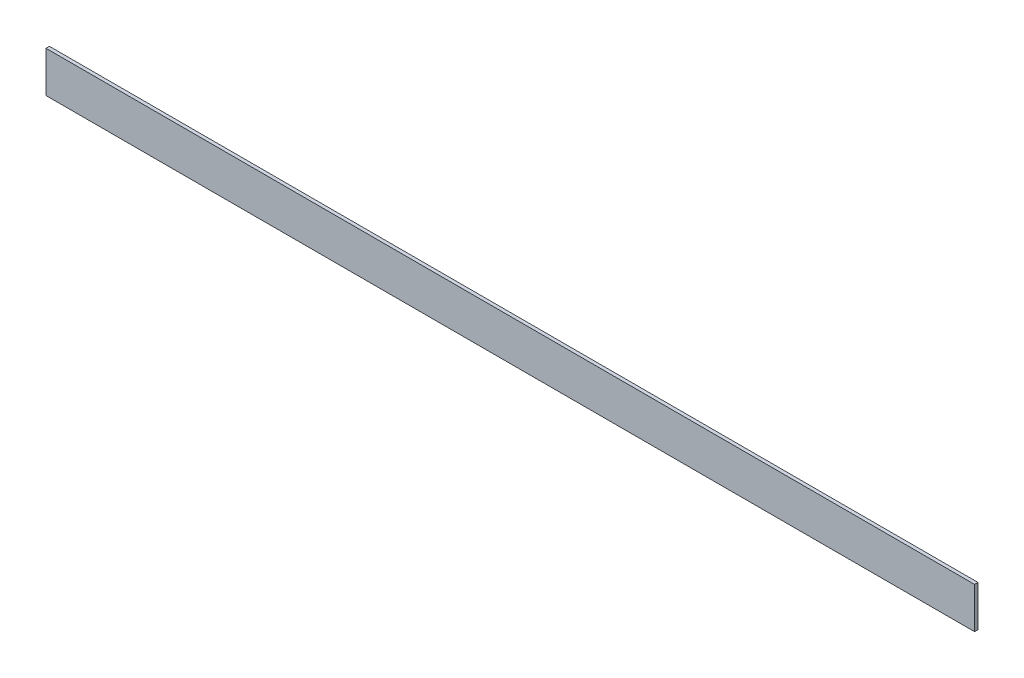
ISO-10303-21;
HEADER;
FILE_DESCRIPTION(('STEP AP214'),'2;1');
FILE_NAME('part.step','',(''),(''),'','','');
FILE_SCHEMA(('AUTOMOTIVE_DESIGN { 1 0 10303 214 1 1 1 1 }'));
ENDSEC;
DATA;
#1=APPLICATION_CONTEXT('core data for automotive mechanical design processes');
#2=APPLICATION_PROTOCOL_DEFINITION('international standard','automotive_design',2000,#1);
#3=PRODUCT_CONTEXT('',#1,'mechanical');
#4=PRODUCT('Part','Part','',(#3));
#5=PRODUCT_RELATED_PRODUCT_CATEGORY('part','',(#4));
#6=PRODUCT_DEFINITION_FORMATION('','',#4);
#7=PRODUCT_DEFINITION_CONTEXT('part definition',#1,'design');
#8=PRODUCT_DEFINITION('design','',#6,#7);
#9=PRODUCT_DEFINITION_SHAPE('','',#8);
#10=(LENGTH_UNIT() NAMED_UNIT(*) SI_UNIT(.MILLI.,.METRE.));
#11=(NAMED_UNIT(*) PLANE_ANGLE_UNIT() SI_UNIT($,.RADIAN.));
#12=(NAMED_UNIT(*) SI_UNIT($,.STERADIAN.) SOLID_ANGLE_UNIT());
#13=UNCERTAINTY_MEASURE_WITH_UNIT(LENGTH_MEASURE(1.E-05),#10,'distance_accuracy_value','');
#14=(GEOMETRIC_REPRESENTATION_CONTEXT(3) GLOBAL_UNCERTAINTY_ASSIGNED_CONTEXT((#13)) GLOBAL_UNIT_ASSIGNED_CONTEXT((#10,
#11,#12)) REPRESENTATION_CONTEXT('',''));
#15=CARTESIAN_POINT('',(0.,0.,0.));
#16=DIRECTION('',(0.,0.,1.));
#17=DIRECTION('',(1.,0.,0.));
#18=AXIS2_PLACEMENT_3D('',#15,#16,#17);
#19=CARTESIAN_POINT('',(1727.2,-38.1,-3.175));
#20=DIRECTION('',(0.,0.,1.));
#21=DIRECTION('',(1.,0.,0.));
#22=AXIS2_PLACEMENT_3D('',#19,#20,#21);
#23=PLANE('',#22);
#24=DIRECTION('',(0.,1.,0.));
#25=VECTOR('',#24,1.);
#26=CARTESIAN_POINT('',(0.,-38.1,-3.175));
#27=LINE('',#26,#25);
#28=CARTESIAN_POINT('',(0.,-38.1,-3.175));
#29=VERTEX_POINT('',#28);
#30=CARTESIAN_POINT('',(0.,38.1,-3.175));
#31=VERTEX_POINT('',#30);
#32=EDGE_CURVE('E98',#29,#31,#27,.T.);
#33=ORIENTED_EDGE('',*,*,#32,.T.);
#34=DIRECTION('',(-1.,0.,0.));
#35=VECTOR('',#34,1.);
#36=CARTESIAN_POINT('',(1727.2,38.1,-3.175));
#37=LINE('',#36,#35);
#38=CARTESIAN_POINT('',(1727.2,38.1,-3.175));
#39=VERTEX_POINT('',#38);
#40=EDGE_CURVE('E11',#39,#31,#37,.T.);
#41=ORIENTED_EDGE('',*,*,#40,.F.);
#42=DIRECTION('',(0.,1.,0.));
#43=VECTOR('',#42,1.);
#44=CARTESIAN_POINT('',(1727.2,-38.1,-3.175));
#45=LINE('',#44,#43);
#46=CARTESIAN_POINT('',(1727.2,-38.1,-3.175));
#47=VERTEX_POINT('',#46);
#48=EDGE_CURVE('E86',#47,#39,#45,.T.);
#49=ORIENTED_EDGE('',*,*,#48,.F.);
#50=DIRECTION('',(-1.,0.,0.));
#51=VECTOR('',#50,1.);
#52=CARTESIAN_POINT('',(1727.2,-38.1,-3.175));
#53=LINE('',#52,#51);
#54=EDGE_CURVE('E94',#47,#29,#53,.T.);
#55=ORIENTED_EDGE('',*,*,#54,.T.);
#56=EDGE_LOOP('',(#33,#41,#49,#55));
#57=FACE_BOUND('',#56,.T.);
#58=ADVANCED_FACE('F35',(#57),#23,.F.);
#59=CARTESIAN_POINT('',(1727.2,38.1,3.175));
#60=DIRECTION('',(0.,-1.,0.));
#61=DIRECTION('',(0.,0.,-1.));
#62=AXIS2_PLACEMENT_3D('',#59,#60,#61);
#63=PLANE('',#62);
#64=DIRECTION('',(0.,0.,1.));
#65=VECTOR('',#64,1.);
#66=CARTESIAN_POINT('',(0.,38.1,3.175));
#67=LINE('',#66,#65);
#68=CARTESIAN_POINT('',(0.,38.1,3.175));
#69=VERTEX_POINT('',#68);
#70=EDGE_CURVE('E90',#31,#69,#67,.T.);
#71=ORIENTED_EDGE('',*,*,#70,.T.);
#72=DIRECTION('',(-1.,0.,0.));
#73=VECTOR('',#72,1.);
#74=CARTESIAN_POINT('',(1727.2,38.1,3.175));
#75=LINE('',#74,#73);
#76=CARTESIAN_POINT('',(1727.2,38.1,3.175));
#77=VERTEX_POINT('',#76);
#78=EDGE_CURVE('E43',#77,#69,#75,.T.);
#79=ORIENTED_EDGE('',*,*,#78,.F.);
#80=DIRECTION('',(0.,0.,1.));
#81=VECTOR('',#80,1.);
#82=CARTESIAN_POINT('',(1727.2,38.1,3.175));
#83=LINE('',#82,#81);
#84=EDGE_CURVE('E81',#39,#77,#83,.T.);
#85=ORIENTED_EDGE('',*,*,#84,.F.);
#86=ORIENTED_EDGE('',*,*,#40,.T.);
#87=EDGE_LOOP('',(#71,#79,#85,#86));
#88=FACE_BOUND('',#87,.T.);
#89=ADVANCED_FACE('F89',(#88),#63,.F.);
#90=CARTESIAN_POINT('',(1727.2,-38.1,3.175));
#91=DIRECTION('',(0.,0.,-1.));
#92=DIRECTION('',(-1.,0.,0.));
#93=AXIS2_PLACEMENT_3D('',#90,#91,#92);
#94=PLANE('',#93);
#95=DIRECTION('',(0.,-1.,0.));
#96=VECTOR('',#95,1.);
#97=CARTESIAN_POINT('',(0.,-38.1,3.175));
#98=LINE('',#97,#96);
#99=CARTESIAN_POINT('',(0.,-38.1,3.175));
#100=VERTEX_POINT('',#99);
#101=EDGE_CURVE('E68',#69,#100,#98,.T.);
#102=ORIENTED_EDGE('',*,*,#101,.T.);
#103=DIRECTION('',(-1.,0.,0.));
#104=VECTOR('',#103,1.);
#105=CARTESIAN_POINT('',(1727.2,-38.1,3.175));
#106=LINE('',#105,#104);
#107=CARTESIAN_POINT('',(1727.2,-38.1,3.175));
#108=VERTEX_POINT('',#107);
#109=EDGE_CURVE('E91',#108,#100,#106,.T.);
#110=ORIENTED_EDGE('',*,*,#109,.F.);
#111=DIRECTION('',(0.,-1.,0.));
#112=VECTOR('',#111,1.);
#113=CARTESIAN_POINT('',(1727.2,-38.1,3.175));
#114=LINE('',#113,#112);
#115=EDGE_CURVE('E84',#77,#108,#114,.T.);
#116=ORIENTED_EDGE('',*,*,#115,.F.);
#117=ORIENTED_EDGE('',*,*,#78,.T.);
#118=EDGE_LOOP('',(#102,#110,#116,#117));
#119=FACE_BOUND('',#118,.T.);
#120=ADVANCED_FACE('F92',(#119),#94,.F.);
#121=CARTESIAN_POINT('',(1727.2,-38.1,3.175));
#122=DIRECTION('',(0.,1.,0.));
#123=DIRECTION('',(0.,0.,1.));
#124=AXIS2_PLACEMENT_3D('',#121,#122,#123);
#125=PLANE('',#124);
#126=DIRECTION('',(0.,0.,-1.));
#127=VECTOR('',#126,1.);
#128=CARTESIAN_POINT('',(0.,-38.1,3.175));
#129=LINE('',#128,#127);
#130=EDGE_CURVE('E74',#100,#29,#129,.T.);
#131=ORIENTED_EDGE('',*,*,#130,.T.);
#132=ORIENTED_EDGE('',*,*,#54,.F.);
#133=DIRECTION('',(0.,0.,-1.));
#134=VECTOR('',#133,1.);
#135=CARTESIAN_POINT('',(1727.2,-38.1,3.175));
#136=LINE('',#135,#134);
#137=EDGE_CURVE('E51',#108,#47,#136,.T.);
#138=ORIENTED_EDGE('',*,*,#137,.F.);
#139=ORIENTED_EDGE('',*,*,#109,.T.);
#140=EDGE_LOOP('',(#131,#132,#138,#139));
#141=FACE_BOUND('',#140,.T.);
#142=ADVANCED_FACE('F105',(#141),#125,.F.);
#143=CARTESIAN_POINT('',(1727.2,0.,0.));
#144=DIRECTION('',(-1.,0.,0.));
#145=DIRECTION('',(0.,0.,1.));
#146=AXIS2_PLACEMENT_3D('',#143,#144,#145);
#147=PLANE('',#146);
#148=ORIENTED_EDGE('',*,*,#48,.T.);
#149=ORIENTED_EDGE('',*,*,#84,.T.);
#150=ORIENTED_EDGE('',*,*,#115,.T.);
#151=ORIENTED_EDGE('',*,*,#137,.T.);
#152=EDGE_LOOP('',(#148,#149,#150,#151));
#153=FACE_BOUND('',#152,.T.);
#154=ADVANCED_FACE('F82',(#153),#147,.F.);
#155=CARTESIAN_POINT('',(0.,0.,0.));
#156=DIRECTION('',(-1.,0.,0.));
#157=DIRECTION('',(0.,0.,1.));
#158=AXIS2_PLACEMENT_3D('',#155,#156,#157);
#159=PLANE('',#158);
#160=ORIENTED_EDGE('',*,*,#32,.F.);
#161=ORIENTED_EDGE('',*,*,#130,.F.);
#162=ORIENTED_EDGE('',*,*,#101,.F.);
#163=ORIENTED_EDGE('',*,*,#70,.F.);
#164=EDGE_LOOP('',(#160,#161,#162,#163));
#165=FACE_BOUND('',#164,.T.);
#166=ADVANCED_FACE('F108',(#165),#159,.T.);
#167=CLOSED_SHELL('',(#58,#89,#120,#142,#154,#166));
#168=MANIFOLD_SOLID_BREP('B2',#167);
#169=ADVANCED_BREP_SHAPE_REPRESENTATION('',(#18,#168),#14);
#170=SHAPE_DEFINITION_REPRESENTATION(#9,#169);
ENDSEC;
END-ISO-10303-21;
